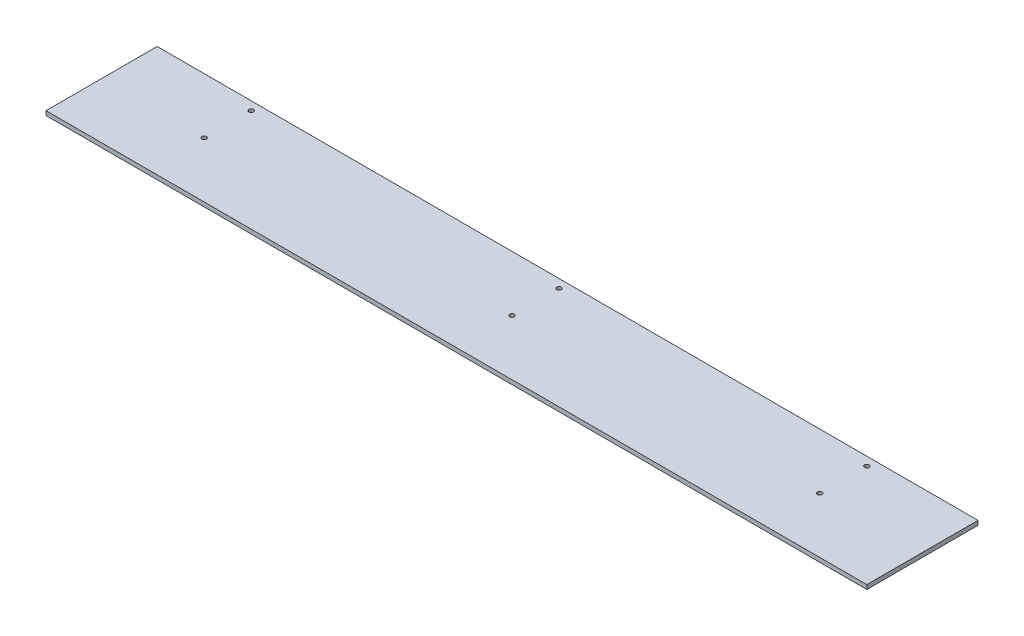
ISO-10303-21;
HEADER;
FILE_DESCRIPTION(('STEP AP214'),'2;1');
FILE_NAME('part.step','',(''),(''),'','','');
FILE_SCHEMA(('AUTOMOTIVE_DESIGN { 1 0 10303 214 1 1 1 1 }'));
ENDSEC;
DATA;
#1=APPLICATION_CONTEXT('core data for automotive mechanical design processes');
#2=APPLICATION_PROTOCOL_DEFINITION('international standard','automotive_design',2000,#1);
#3=PRODUCT_CONTEXT('',#1,'mechanical');
#4=PRODUCT('Part','Part','',(#3));
#5=PRODUCT_RELATED_PRODUCT_CATEGORY('part','',(#4));
#6=PRODUCT_DEFINITION_FORMATION('','',#4);
#7=PRODUCT_DEFINITION_CONTEXT('part definition',#1,'design');
#8=PRODUCT_DEFINITION('design','',#6,#7);
#9=PRODUCT_DEFINITION_SHAPE('','',#8);
#10=(LENGTH_UNIT() NAMED_UNIT(*) SI_UNIT(.MILLI.,.METRE.));
#11=(NAMED_UNIT(*) PLANE_ANGLE_UNIT() SI_UNIT($,.RADIAN.));
#12=(NAMED_UNIT(*) SI_UNIT($,.STERADIAN.) SOLID_ANGLE_UNIT());
#13=UNCERTAINTY_MEASURE_WITH_UNIT(LENGTH_MEASURE(1.E-05),#10,'distance_accuracy_value','');
#14=(GEOMETRIC_REPRESENTATION_CONTEXT(3) GLOBAL_UNCERTAINTY_ASSIGNED_CONTEXT((#13)) GLOBAL_UNIT_ASSIGNED_CONTEXT((#10,
#11,#12)) REPRESENTATION_CONTEXT('',''));
#15=CARTESIAN_POINT('',(0.,0.,0.));
#16=DIRECTION('',(0.,0.,1.));
#17=DIRECTION('',(1.,0.,0.));
#18=AXIS2_PLACEMENT_3D('',#15,#16,#17);
#19=CARTESIAN_POINT('',(609.6,-6.35,-1424.52631225586));
#20=DIRECTION('',(0.,0.,1.));
#21=DIRECTION('',(1.,0.,0.));
#22=AXIS2_PLACEMENT_3D('',#19,#20,#21);
#23=PLANE('',#22);
#24=DIRECTION('',(1.,0.,0.));
#25=VECTOR('',#24,1.);
#26=CARTESIAN_POINT('',(609.6,0.,-1424.52631225586));
#27=LINE('',#26,#25);
#28=CARTESIAN_POINT('',(0.,0.,-1424.52631225586));
#29=VERTEX_POINT('',#28);
#30=CARTESIAN_POINT('',(1219.2,0.,-1424.52631225586));
#31=VERTEX_POINT('',#30);
#32=EDGE_CURVE('E106',#29,#31,#27,.T.);
#33=ORIENTED_EDGE('',*,*,#32,.F.);
#34=DIRECTION('',(0.,1.,0.));
#35=VECTOR('',#34,1.);
#36=CARTESIAN_POINT('',(0.,-6.35,-1424.52631225586));
#37=LINE('',#36,#35);
#38=CARTESIAN_POINT('',(0.,-6.35,-1424.52631225586));
#39=VERTEX_POINT('',#38);
#40=EDGE_CURVE('E11',#39,#29,#37,.T.);
#41=ORIENTED_EDGE('',*,*,#40,.F.);
#42=DIRECTION('',(1.,0.,0.));
#43=VECTOR('',#42,1.);
#44=CARTESIAN_POINT('',(609.6,-6.35,-1424.52631225586));
#45=LINE('',#44,#43);
#46=CARTESIAN_POINT('',(1219.2,-6.35,-1424.52631225586));
#47=VERTEX_POINT('',#46);
#48=EDGE_CURVE('E82',#39,#47,#45,.T.);
#49=ORIENTED_EDGE('',*,*,#48,.T.);
#50=DIRECTION('',(0.,1.,0.));
#51=VECTOR('',#50,1.);
#52=CARTESIAN_POINT('',(1219.2,-6.35,-1424.52631225586));
#53=LINE('',#52,#51);
#54=EDGE_CURVE('E40',#47,#31,#53,.T.);
#55=ORIENTED_EDGE('',*,*,#54,.T.);
#56=EDGE_LOOP('',(#33,#41,#49,#55));
#57=FACE_BOUND('',#56,.T.);
#58=ADVANCED_FACE('F16',(#57),#23,.T.);
#59=CARTESIAN_POINT('',(0.,-6.35,-1507.07631225586));
#60=DIRECTION('',(1.,0.,0.));
#61=DIRECTION('',(0.,0.,-1.));
#62=AXIS2_PLACEMENT_3D('',#59,#60,#61);
#63=PLANE('',#62);
#64=DIRECTION('',(0.,0.,-1.));
#65=VECTOR('',#64,1.);
#66=CARTESIAN_POINT('',(0.,0.,-1507.07631225586));
#67=LINE('',#66,#65);
#68=CARTESIAN_POINT('',(0.,0.,-1589.62631225586));
#69=VERTEX_POINT('',#68);
#70=EDGE_CURVE('E89',#29,#69,#67,.T.);
#71=ORIENTED_EDGE('',*,*,#70,.T.);
#72=DIRECTION('',(0.,1.,0.));
#73=VECTOR('',#72,1.);
#74=CARTESIAN_POINT('',(0.,-6.35,-1589.62631225586));
#75=LINE('',#74,#73);
#76=CARTESIAN_POINT('',(0.,-6.35,-1589.62631225586));
#77=VERTEX_POINT('',#76);
#78=EDGE_CURVE('E26',#77,#69,#75,.T.);
#79=ORIENTED_EDGE('',*,*,#78,.F.);
#80=DIRECTION('',(0.,0.,-1.));
#81=VECTOR('',#80,1.);
#82=CARTESIAN_POINT('',(0.,-6.35,-1507.07631225586));
#83=LINE('',#82,#81);
#84=EDGE_CURVE('E76',#39,#77,#83,.T.);
#85=ORIENTED_EDGE('',*,*,#84,.F.);
#86=ORIENTED_EDGE('',*,*,#40,.T.);
#87=EDGE_LOOP('',(#71,#79,#85,#86));
#88=FACE_BOUND('',#87,.T.);
#89=ADVANCED_FACE('F87',(#88),#63,.F.);
#90=CARTESIAN_POINT('',(609.6,-6.35,-1589.62631225586));
#91=DIRECTION('',(0.,0.,1.));
#92=DIRECTION('',(1.,0.,0.));
#93=AXIS2_PLACEMENT_3D('',#90,#91,#92);
#94=PLANE('',#93);
#95=DIRECTION('',(1.,0.,0.));
#96=VECTOR('',#95,1.);
#97=CARTESIAN_POINT('',(609.6,0.,-1589.62631225586));
#98=LINE('',#97,#96);
#99=CARTESIAN_POINT('',(1219.2,0.,-1589.62631225586));
#100=VERTEX_POINT('',#99);
#101=EDGE_CURVE('E111',#69,#100,#98,.T.);
#102=ORIENTED_EDGE('',*,*,#101,.T.);
#103=DIRECTION('',(0.,1.,0.));
#104=VECTOR('',#103,1.);
#105=CARTESIAN_POINT('',(1219.2,-6.35,-1589.62631225586));
#106=LINE('',#105,#104);
#107=CARTESIAN_POINT('',(1219.2,-6.35,-1589.62631225586));
#108=VERTEX_POINT('',#107);
#109=EDGE_CURVE('E59',#108,#100,#106,.T.);
#110=ORIENTED_EDGE('',*,*,#109,.F.);
#111=DIRECTION('',(1.,0.,0.));
#112=VECTOR('',#111,1.);
#113=CARTESIAN_POINT('',(609.6,-6.35,-1589.62631225586));
#114=LINE('',#113,#112);
#115=EDGE_CURVE('E81',#77,#108,#114,.T.);
#116=ORIENTED_EDGE('',*,*,#115,.F.);
#117=ORIENTED_EDGE('',*,*,#78,.T.);
#118=EDGE_LOOP('',(#102,#110,#116,#117));
#119=FACE_BOUND('',#118,.T.);
#120=ADVANCED_FACE('F94',(#119),#94,.F.);
#121=CARTESIAN_POINT('',(1219.2,-6.35,-1507.07631225586));
#122=DIRECTION('',(1.,0.,0.));
#123=DIRECTION('',(0.,0.,-1.));
#124=AXIS2_PLACEMENT_3D('',#121,#122,#123);
#125=PLANE('',#124);
#126=DIRECTION('',(0.,0.,-1.));
#127=VECTOR('',#126,1.);
#128=CARTESIAN_POINT('',(1219.2,0.,-1507.07631225586));
#129=LINE('',#128,#127);
#130=EDGE_CURVE('E113',#31,#100,#129,.T.);
#131=ORIENTED_EDGE('',*,*,#130,.F.);
#132=ORIENTED_EDGE('',*,*,#54,.F.);
#133=DIRECTION('',(0.,0.,-1.));
#134=VECTOR('',#133,1.);
#135=CARTESIAN_POINT('',(1219.2,-6.35,-1507.07631225586));
#136=LINE('',#135,#134);
#137=EDGE_CURVE('E96',#47,#108,#136,.T.);
#138=ORIENTED_EDGE('',*,*,#137,.T.);
#139=ORIENTED_EDGE('',*,*,#109,.T.);
#140=EDGE_LOOP('',(#131,#132,#138,#139));
#141=FACE_BOUND('',#140,.T.);
#142=ADVANCED_FACE('F171',(#141),#125,.T.);
#143=CARTESIAN_POINT('',(609.6,-6.35,-1507.07631225586));
#144=DIRECTION('',(0.,-1.,0.));
#145=DIRECTION('',(1.,0.,0.));
#146=AXIS2_PLACEMENT_3D('',#143,#144,#145);
#147=PLANE('',#146);
#148=CARTESIAN_POINT('',(1066.8,-6.35000000000008,-1507.07631225586));
#149=DIRECTION('',(0.,-1.,0.));
#150=DIRECTION('',(0.,0.,-1.));
#151=AXIS2_PLACEMENT_3D('',#148,#149,#150);
#152=CIRCLE('',#151,3.36549999999991);
#153=CARTESIAN_POINT('',(1066.8,-6.35000000000008,-1510.44181225586));
#154=VERTEX_POINT('',#153);
#155=EDGE_CURVE('E158',#154,#154,#152,.T.);
#156=ORIENTED_EDGE('',*,*,#155,.F.);
#157=EDGE_LOOP('',(#156));
#158=FACE_BOUND('',#157,.T.);
#159=CARTESIAN_POINT('',(1066.8,-6.35000000000008,-1576.92631225586));
#160=DIRECTION('',(0.,-1.,0.));
#161=DIRECTION('',(0.,0.,-1.));
#162=AXIS2_PLACEMENT_3D('',#159,#160,#161);
#163=CIRCLE('',#162,3.36549999999991);
#164=CARTESIAN_POINT('',(1066.8,-6.35000000000008,-1580.29181225586));
#165=VERTEX_POINT('',#164);
#166=EDGE_CURVE('E142',#165,#165,#163,.T.);
#167=ORIENTED_EDGE('',*,*,#166,.F.);
#168=EDGE_LOOP('',(#167));
#169=FACE_BOUND('',#168,.T.);
#170=CARTESIAN_POINT('',(152.4,-6.35000000000008,-1576.92631225586));
#171=DIRECTION('',(0.,-1.,0.));
#172=DIRECTION('',(0.,0.,-1.));
#173=AXIS2_PLACEMENT_3D('',#170,#171,#172);
#174=CIRCLE('',#173,3.3655);
#175=CARTESIAN_POINT('',(152.4,-6.35000000000008,-1580.29181225586));
#176=VERTEX_POINT('',#175);
#177=EDGE_CURVE('E138',#176,#176,#174,.T.);
#178=ORIENTED_EDGE('',*,*,#177,.F.);
#179=EDGE_LOOP('',(#178));
#180=FACE_BOUND('',#179,.T.);
#181=CARTESIAN_POINT('',(152.4,-6.35000000000008,-1507.07631225586));
#182=DIRECTION('',(0.,-1.,0.));
#183=DIRECTION('',(0.,0.,-1.));
#184=AXIS2_PLACEMENT_3D('',#181,#182,#183);
#185=CIRCLE('',#184,3.3655);
#186=CARTESIAN_POINT('',(152.4,-6.35000000000008,-1510.44181225586));
#187=VERTEX_POINT('',#186);
#188=EDGE_CURVE('E134',#187,#187,#185,.T.);
#189=ORIENTED_EDGE('',*,*,#188,.F.);
#190=EDGE_LOOP('',(#189));
#191=FACE_BOUND('',#190,.T.);
#192=CARTESIAN_POINT('',(609.6,-6.35000000000008,-1576.92631225586));
#193=DIRECTION('',(0.,-1.,0.));
#194=DIRECTION('',(0.,0.,-1.));
#195=AXIS2_PLACEMENT_3D('',#192,#193,#194);
#196=CIRCLE('',#195,3.3655);
#197=CARTESIAN_POINT('',(609.6,-6.35000000000008,-1580.29181225586));
#198=VERTEX_POINT('',#197);
#199=EDGE_CURVE('E129',#198,#198,#196,.T.);
#200=ORIENTED_EDGE('',*,*,#199,.F.);
#201=EDGE_LOOP('',(#200));
#202=FACE_BOUND('',#201,.T.);
#203=CARTESIAN_POINT('',(609.6,-6.35000000000008,-1507.07631225586));
#204=DIRECTION('',(0.,-1.,0.));
#205=DIRECTION('',(0.,0.,-1.));
#206=AXIS2_PLACEMENT_3D('',#203,#204,#205);
#207=CIRCLE('',#206,3.3655);
#208=CARTESIAN_POINT('',(609.6,-6.35000000000008,-1510.44181225586));
#209=VERTEX_POINT('',#208);
#210=EDGE_CURVE('E124',#209,#209,#207,.T.);
#211=ORIENTED_EDGE('',*,*,#210,.F.);
#212=EDGE_LOOP('',(#211));
#213=FACE_BOUND('',#212,.T.);
#214=ORIENTED_EDGE('',*,*,#48,.F.);
#215=ORIENTED_EDGE('',*,*,#84,.T.);
#216=ORIENTED_EDGE('',*,*,#115,.T.);
#217=ORIENTED_EDGE('',*,*,#137,.F.);
#218=EDGE_LOOP('',(#214,#215,#216,#217));
#219=FACE_BOUND('',#218,.T.);
#220=ADVANCED_FACE('F78',(#158,#169,#180,#191,#202,#213,#219),#147,.T.);
#221=CARTESIAN_POINT('',(609.6,0.,-1507.07631225586));
#222=DIRECTION('',(0.,-1.,0.));
#223=DIRECTION('',(1.,0.,0.));
#224=AXIS2_PLACEMENT_3D('',#221,#222,#223);
#225=PLANE('',#224);
#226=CARTESIAN_POINT('',(1066.8,0.,-1507.07631225586));
#227=DIRECTION('',(0.,-1.,0.));
#228=DIRECTION('',(0.,0.,-1.));
#229=AXIS2_PLACEMENT_3D('',#226,#227,#228);
#230=CIRCLE('',#229,3.36549999999991);
#231=CARTESIAN_POINT('',(1066.8,0.,-1510.44181225586));
#232=VERTEX_POINT('',#231);
#233=EDGE_CURVE('E19',#232,#232,#230,.F.);
#234=ORIENTED_EDGE('',*,*,#233,.F.);
#235=EDGE_LOOP('',(#234));
#236=FACE_BOUND('',#235,.T.);
#237=CARTESIAN_POINT('',(1066.8,0.,-1576.92631225586));
#238=DIRECTION('',(0.,-1.,0.));
#239=DIRECTION('',(0.,0.,-1.));
#240=AXIS2_PLACEMENT_3D('',#237,#238,#239);
#241=CIRCLE('',#240,3.36549999999991);
#242=CARTESIAN_POINT('',(1066.8,0.,-1580.29181225586));
#243=VERTEX_POINT('',#242);
#244=EDGE_CURVE('E139',#243,#243,#241,.F.);
#245=ORIENTED_EDGE('',*,*,#244,.F.);
#246=EDGE_LOOP('',(#245));
#247=FACE_BOUND('',#246,.T.);
#248=CARTESIAN_POINT('',(152.4,0.,-1576.92631225586));
#249=DIRECTION('',(0.,-1.,0.));
#250=DIRECTION('',(0.,0.,-1.));
#251=AXIS2_PLACEMENT_3D('',#248,#249,#250);
#252=CIRCLE('',#251,3.3655);
#253=CARTESIAN_POINT('',(152.4,0.,-1580.29181225586));
#254=VERTEX_POINT('',#253);
#255=EDGE_CURVE('E135',#254,#254,#252,.F.);
#256=ORIENTED_EDGE('',*,*,#255,.F.);
#257=EDGE_LOOP('',(#256));
#258=FACE_BOUND('',#257,.T.);
#259=CARTESIAN_POINT('',(152.4,0.,-1507.07631225586));
#260=DIRECTION('',(0.,-1.,0.));
#261=DIRECTION('',(0.,0.,-1.));
#262=AXIS2_PLACEMENT_3D('',#259,#260,#261);
#263=CIRCLE('',#262,3.3655);
#264=CARTESIAN_POINT('',(152.4,0.,-1510.44181225586));
#265=VERTEX_POINT('',#264);
#266=EDGE_CURVE('E130',#265,#265,#263,.F.);
#267=ORIENTED_EDGE('',*,*,#266,.F.);
#268=EDGE_LOOP('',(#267));
#269=FACE_BOUND('',#268,.T.);
#270=CARTESIAN_POINT('',(609.6,0.,-1576.92631225586));
#271=DIRECTION('',(0.,-1.,0.));
#272=DIRECTION('',(0.,0.,-1.));
#273=AXIS2_PLACEMENT_3D('',#270,#271,#272);
#274=CIRCLE('',#273,3.3655);
#275=CARTESIAN_POINT('',(609.6,0.,-1580.29181225586));
#276=VERTEX_POINT('',#275);
#277=EDGE_CURVE('E125',#276,#276,#274,.F.);
#278=ORIENTED_EDGE('',*,*,#277,.F.);
#279=EDGE_LOOP('',(#278));
#280=FACE_BOUND('',#279,.T.);
#281=CARTESIAN_POINT('',(609.6,0.,-1507.07631225586));
#282=DIRECTION('',(0.,-1.,0.));
#283=DIRECTION('',(0.,0.,-1.));
#284=AXIS2_PLACEMENT_3D('',#281,#282,#283);
#285=CIRCLE('',#284,3.3655);
#286=CARTESIAN_POINT('',(609.6,0.,-1510.44181225586));
#287=VERTEX_POINT('',#286);
#288=EDGE_CURVE('E109',#287,#287,#285,.F.);
#289=ORIENTED_EDGE('',*,*,#288,.F.);
#290=EDGE_LOOP('',(#289));
#291=FACE_BOUND('',#290,.T.);
#292=ORIENTED_EDGE('',*,*,#32,.T.);
#293=ORIENTED_EDGE('',*,*,#130,.T.);
#294=ORIENTED_EDGE('',*,*,#101,.F.);
#295=ORIENTED_EDGE('',*,*,#70,.F.);
#296=EDGE_LOOP('',(#292,#293,#294,#295));
#297=FACE_BOUND('',#296,.T.);
#298=ADVANCED_FACE('F179',(#236,#247,#258,#269,#280,#291,#297),#225,.F.);
#299=CARTESIAN_POINT('',(609.6,1225.005347797,-1507.07631225586));
#300=DIRECTION('',(0.,-1.,0.));
#301=DIRECTION('',(0.,0.,-1.));
#302=AXIS2_PLACEMENT_3D('',#299,#300,#301);
#303=CYLINDRICAL_SURFACE('',#302,3.3655);
#304=ORIENTED_EDGE('',*,*,#210,.T.);
#305=EDGE_LOOP('',(#304));
#306=FACE_BOUND('',#305,.T.);
#307=ORIENTED_EDGE('',*,*,#288,.T.);
#308=EDGE_LOOP('',(#307));
#309=FACE_BOUND('',#308,.T.);
#310=ADVANCED_FACE('F221',(#306,#309),#303,.F.);
#311=CARTESIAN_POINT('',(609.6,1225.005347797,-1576.92631225586));
#312=DIRECTION('',(0.,-1.,0.));
#313=DIRECTION('',(0.,0.,-1.));
#314=AXIS2_PLACEMENT_3D('',#311,#312,#313);
#315=CYLINDRICAL_SURFACE('',#314,3.3655);
#316=ORIENTED_EDGE('',*,*,#199,.T.);
#317=EDGE_LOOP('',(#316));
#318=FACE_BOUND('',#317,.T.);
#319=ORIENTED_EDGE('',*,*,#277,.T.);
#320=EDGE_LOOP('',(#319));
#321=FACE_BOUND('',#320,.T.);
#322=ADVANCED_FACE('F231',(#318,#321),#315,.F.);
#323=CARTESIAN_POINT('',(152.4,1225.005347797,-1507.07631225586));
#324=DIRECTION('',(0.,-1.,0.));
#325=DIRECTION('',(0.,0.,-1.));
#326=AXIS2_PLACEMENT_3D('',#323,#324,#325);
#327=CYLINDRICAL_SURFACE('',#326,3.3655);
#328=ORIENTED_EDGE('',*,*,#188,.T.);
#329=EDGE_LOOP('',(#328));
#330=FACE_BOUND('',#329,.T.);
#331=ORIENTED_EDGE('',*,*,#266,.T.);
#332=EDGE_LOOP('',(#331));
#333=FACE_BOUND('',#332,.T.);
#334=ADVANCED_FACE('F242',(#330,#333),#327,.F.);
#335=CARTESIAN_POINT('',(152.4,1225.005347797,-1576.92631225586));
#336=DIRECTION('',(0.,-1.,0.));
#337=DIRECTION('',(0.,0.,-1.));
#338=AXIS2_PLACEMENT_3D('',#335,#336,#337);
#339=CYLINDRICAL_SURFACE('',#338,3.3655);
#340=ORIENTED_EDGE('',*,*,#177,.T.);
#341=EDGE_LOOP('',(#340));
#342=FACE_BOUND('',#341,.T.);
#343=ORIENTED_EDGE('',*,*,#255,.T.);
#344=EDGE_LOOP('',(#343));
#345=FACE_BOUND('',#344,.T.);
#346=ADVANCED_FACE('F253',(#342,#345),#339,.F.);
#347=CARTESIAN_POINT('',(1066.8,1225.005347797,-1576.92631225586));
#348=DIRECTION('',(0.,-1.,0.));
#349=DIRECTION('',(0.,0.,-1.));
#350=AXIS2_PLACEMENT_3D('',#347,#348,#349);
#351=CYLINDRICAL_SURFACE('',#350,3.36549999999991);
#352=ORIENTED_EDGE('',*,*,#166,.T.);
#353=EDGE_LOOP('',(#352));
#354=FACE_BOUND('',#353,.T.);
#355=ORIENTED_EDGE('',*,*,#244,.T.);
#356=EDGE_LOOP('',(#355));
#357=FACE_BOUND('',#356,.T.);
#358=ADVANCED_FACE('F264',(#354,#357),#351,.F.);
#359=CARTESIAN_POINT('',(1066.8,1225.005347797,-1507.07631225586));
#360=DIRECTION('',(0.,-1.,0.));
#361=DIRECTION('',(0.,0.,-1.));
#362=AXIS2_PLACEMENT_3D('',#359,#360,#361);
#363=CYLINDRICAL_SURFACE('',#362,3.36549999999991);
#364=ORIENTED_EDGE('',*,*,#155,.T.);
#365=EDGE_LOOP('',(#364));
#366=FACE_BOUND('',#365,.T.);
#367=ORIENTED_EDGE('',*,*,#233,.T.);
#368=EDGE_LOOP('',(#367));
#369=FACE_BOUND('',#368,.T.);
#370=ADVANCED_FACE('F275',(#366,#369),#363,.F.);
#371=CLOSED_SHELL('',(#58,#89,#120,#142,#220,#298,#310,#322,#334,#346,#358,#370));
#372=MANIFOLD_SOLID_BREP('B1',#371);
#373=ADVANCED_BREP_SHAPE_REPRESENTATION('',(#18,#372),#14);
#374=SHAPE_DEFINITION_REPRESENTATION(#9,#373);
ENDSEC;
END-ISO-10303-21;
